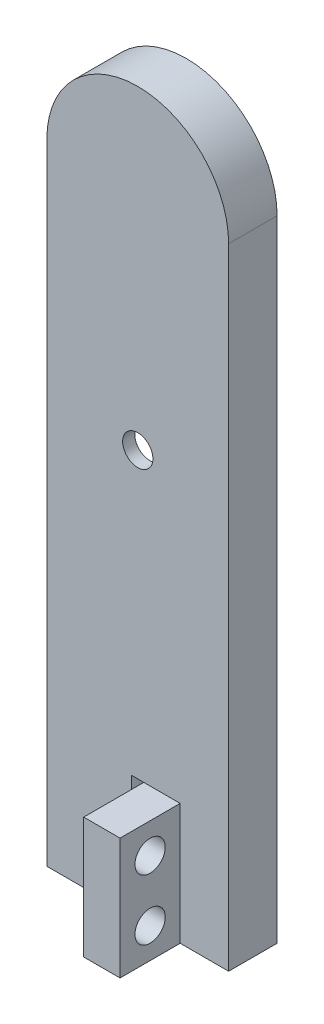
ISO-10303-21;
HEADER;
FILE_DESCRIPTION(('STEP AP214'),'2;1');
FILE_NAME('part.step','',(''),(''),'','','');
FILE_SCHEMA(('AUTOMOTIVE_DESIGN { 1 0 10303 214 1 1 1 1 }'));
ENDSEC;
DATA;
#1=APPLICATION_CONTEXT('core data for automotive mechanical design processes');
#2=APPLICATION_PROTOCOL_DEFINITION('international standard','automotive_design',2000,#1);
#3=PRODUCT_CONTEXT('',#1,'mechanical');
#4=PRODUCT('Part','Part','',(#3));
#5=PRODUCT_RELATED_PRODUCT_CATEGORY('part','',(#4));
#6=PRODUCT_DEFINITION_FORMATION('','',#4);
#7=PRODUCT_DEFINITION_CONTEXT('part definition',#1,'design');
#8=PRODUCT_DEFINITION('design','',#6,#7);
#9=PRODUCT_DEFINITION_SHAPE('','',#8);
#10=(LENGTH_UNIT() NAMED_UNIT(*) SI_UNIT(.MILLI.,.METRE.));
#11=(NAMED_UNIT(*) PLANE_ANGLE_UNIT() SI_UNIT($,.RADIAN.));
#12=(NAMED_UNIT(*) SI_UNIT($,.STERADIAN.) SOLID_ANGLE_UNIT());
#13=UNCERTAINTY_MEASURE_WITH_UNIT(LENGTH_MEASURE(1.E-05),#10,'distance_accuracy_value','');
#14=(GEOMETRIC_REPRESENTATION_CONTEXT(3) GLOBAL_UNCERTAINTY_ASSIGNED_CONTEXT((#13)) GLOBAL_UNIT_ASSIGNED_CONTEXT((#10,
#11,#12)) REPRESENTATION_CONTEXT('',''));
#15=CARTESIAN_POINT('',(0.,0.,0.));
#16=DIRECTION('',(0.,0.,1.));
#17=DIRECTION('',(1.,0.,0.));
#18=AXIS2_PLACEMENT_3D('',#15,#16,#17);
#19=CARTESIAN_POINT('',(0.,52.,4.));
#20=DIRECTION('',(0.,0.,1.));
#21=DIRECTION('',(1.,0.,0.));
#22=AXIS2_PLACEMENT_3D('',#19,#20,#21);
#23=PLANE('',#22);
#24=CARTESIAN_POINT('',(0.,33.5,4.));
#25=DIRECTION('',(0.,0.,1.));
#26=DIRECTION('',(1.,0.,0.));
#27=AXIS2_PLACEMENT_3D('',#24,#25,#26);
#28=CIRCLE('',#27,1.25);
#29=CARTESIAN_POINT('',(1.25,33.5,4.));
#30=VERTEX_POINT('',#29);
#31=EDGE_CURVE('E202',#30,#30,#28,.F.);
#32=ORIENTED_EDGE('',*,*,#31,.T.);
#33=EDGE_LOOP('',(#32));
#34=FACE_BOUND('',#33,.T.);
#35=DIRECTION('',(1.,0.,0.));
#36=VECTOR('',#35,1.);
#37=CARTESIAN_POINT('',(0.,10.,4.));
#38=LINE('',#37,#36);
#39=CARTESIAN_POINT('',(-0.499999999999999,10.,4.));
#40=VERTEX_POINT('',#39);
#41=CARTESIAN_POINT('',(0.499999999999999,10.,4.));
#42=VERTEX_POINT('',#41);
#43=EDGE_CURVE('E199',#40,#42,#38,.T.);
#44=ORIENTED_EDGE('',*,*,#43,.T.);
#45=DIRECTION('',(1.,0.,0.));
#46=VECTOR('',#45,1.);
#47=CARTESIAN_POINT('',(0.,10.,4.));
#48=LINE('',#47,#46);
#49=CARTESIAN_POINT('',(3.5,10.,4.));
#50=VERTEX_POINT('',#49);
#51=EDGE_CURVE('E53',#42,#50,#48,.T.);
#52=ORIENTED_EDGE('',*,*,#51,.T.);
#53=DIRECTION('',(0.,1.,0.));
#54=VECTOR('',#53,1.);
#55=CARTESIAN_POINT('',(3.5,52.,4.));
#56=LINE('',#55,#54);
#57=CARTESIAN_POINT('',(3.5,0.,4.));
#58=VERTEX_POINT('',#57);
#59=EDGE_CURVE('E11',#58,#50,#56,.T.);
#60=ORIENTED_EDGE('',*,*,#59,.F.);
#61=DIRECTION('',(1.,0.,0.));
#62=VECTOR('',#61,1.);
#63=CARTESIAN_POINT('',(7.5,0.,4.));
#64=LINE('',#63,#62);
#65=CARTESIAN_POINT('',(7.5,0.,4.));
#66=VERTEX_POINT('',#65);
#67=EDGE_CURVE('E157',#58,#66,#64,.T.);
#68=ORIENTED_EDGE('',*,*,#67,.T.);
#69=DIRECTION('',(0.,1.,0.));
#70=VECTOR('',#69,1.);
#71=CARTESIAN_POINT('',(7.5,0.,4.));
#72=LINE('',#71,#70);
#73=CARTESIAN_POINT('',(7.5,52.,4.));
#74=VERTEX_POINT('',#73);
#75=EDGE_CURVE('E253',#66,#74,#72,.T.);
#76=ORIENTED_EDGE('',*,*,#75,.T.);
#77=CARTESIAN_POINT('',(0.,52.,4.));
#78=DIRECTION('',(0.,0.,1.));
#79=DIRECTION('',(1.,0.,0.));
#80=AXIS2_PLACEMENT_3D('',#77,#78,#79);
#81=CIRCLE('',#80,7.5);
#82=CARTESIAN_POINT('',(-7.5,52.,4.));
#83=VERTEX_POINT('',#82);
#84=EDGE_CURVE('E255',#74,#83,#81,.T.);
#85=ORIENTED_EDGE('',*,*,#84,.T.);
#86=DIRECTION('',(0.,-1.,0.));
#87=VECTOR('',#86,1.);
#88=CARTESIAN_POINT('',(-7.5,0.,4.));
#89=LINE('',#88,#87);
#90=CARTESIAN_POINT('',(-7.5,0.,4.));
#91=VERTEX_POINT('',#90);
#92=EDGE_CURVE('E257',#83,#91,#89,.T.);
#93=ORIENTED_EDGE('',*,*,#92,.T.);
#94=CARTESIAN_POINT('',(-0.5,0.,4.));
#95=VERTEX_POINT('',#94);
#96=EDGE_CURVE('E250',#91,#95,#64,.T.);
#97=ORIENTED_EDGE('',*,*,#96,.T.);
#98=DIRECTION('',(0.,1.,0.));
#99=VECTOR('',#98,1.);
#100=CARTESIAN_POINT('',(-0.499999999999997,52.,4.));
#101=LINE('',#100,#99);
#102=EDGE_CURVE('E196',#95,#40,#101,.T.);
#103=ORIENTED_EDGE('',*,*,#102,.T.);
#104=EDGE_LOOP('',(#44,#52,#60,#68,#76,#85,#93,#97,#103));
#105=FACE_BOUND('',#104,.T.);
#106=ADVANCED_FACE('F36',(#34,#105),#23,.T.);
#107=CARTESIAN_POINT('',(7.5,0.,4.));
#108=DIRECTION('',(0.,1.,0.));
#109=DIRECTION('',(0.,0.,1.));
#110=AXIS2_PLACEMENT_3D('',#107,#108,#109);
#111=PLANE('',#110);
#112=DIRECTION('',(0.,0.,-1.));
#113=VECTOR('',#112,1.);
#114=CARTESIAN_POINT('',(0.5,0.,16.3));
#115=LINE('',#114,#113);
#116=CARTESIAN_POINT('',(0.5,0.,8.96178465974861));
#117=VERTEX_POINT('',#116);
#118=CARTESIAN_POINT('',(0.5,0.,0.));
#119=VERTEX_POINT('',#118);
#120=EDGE_CURVE('E194',#117,#119,#115,.T.);
#121=ORIENTED_EDGE('',*,*,#120,.T.);
#122=DIRECTION('',(1.,0.,0.));
#123=VECTOR('',#122,1.);
#124=CARTESIAN_POINT('',(7.5,0.,0.));
#125=LINE('',#124,#123);
#126=CARTESIAN_POINT('',(7.5,0.,0.));
#127=VERTEX_POINT('',#126);
#128=EDGE_CURVE('E249',#119,#127,#125,.T.);
#129=ORIENTED_EDGE('',*,*,#128,.T.);
#130=DIRECTION('',(0.,0.,-1.));
#131=VECTOR('',#130,1.);
#132=CARTESIAN_POINT('',(7.5,0.,4.));
#133=LINE('',#132,#131);
#134=EDGE_CURVE('E45',#66,#127,#133,.T.);
#135=ORIENTED_EDGE('',*,*,#134,.F.);
#136=ORIENTED_EDGE('',*,*,#67,.F.);
#137=DIRECTION('',(0.,0.,-1.));
#138=VECTOR('',#137,1.);
#139=CARTESIAN_POINT('',(3.5,0.,8.96178465974861));
#140=LINE('',#139,#138);
#141=CARTESIAN_POINT('',(3.5,0.,8.96178465974861));
#142=VERTEX_POINT('',#141);
#143=EDGE_CURVE('E151',#142,#58,#140,.T.);
#144=ORIENTED_EDGE('',*,*,#143,.F.);
#145=DIRECTION('',(-1.,0.,0.));
#146=VECTOR('',#145,1.);
#147=CARTESIAN_POINT('',(3.5,0.,8.96178465974861));
#148=LINE('',#147,#146);
#149=EDGE_CURVE('E154',#142,#117,#148,.T.);
#150=ORIENTED_EDGE('',*,*,#149,.T.);
#151=EDGE_LOOP('',(#121,#129,#135,#136,#144,#150));
#152=FACE_BOUND('',#151,.T.);
#153=ADVANCED_FACE('F38',(#152),#111,.F.);
#154=DIRECTION('',(0.,0.,-1.));
#155=VECTOR('',#154,1.);
#156=CARTESIAN_POINT('',(-0.5,0.,16.3));
#157=LINE('',#156,#155);
#158=CARTESIAN_POINT('',(-0.499999999999999,0.,0.));
#159=VERTEX_POINT('',#158);
#160=EDGE_CURVE('E188',#95,#159,#157,.T.);
#161=ORIENTED_EDGE('',*,*,#160,.F.);
#162=ORIENTED_EDGE('',*,*,#96,.F.);
#163=DIRECTION('',(0.,0.,-1.));
#164=VECTOR('',#163,1.);
#165=CARTESIAN_POINT('',(-7.5,0.,4.));
#166=LINE('',#165,#164);
#167=CARTESIAN_POINT('',(-7.5,0.,0.));
#168=VERTEX_POINT('',#167);
#169=EDGE_CURVE('E259',#91,#168,#166,.T.);
#170=ORIENTED_EDGE('',*,*,#169,.T.);
#171=EDGE_CURVE('E260',#168,#159,#125,.T.);
#172=ORIENTED_EDGE('',*,*,#171,.T.);
#173=EDGE_LOOP('',(#161,#162,#170,#172));
#174=FACE_BOUND('',#173,.T.);
#175=ADVANCED_FACE('F323',(#174),#111,.F.);
#176=CARTESIAN_POINT('',(0.,52.,0.));
#177=DIRECTION('',(0.,0.,1.));
#178=DIRECTION('',(1.,0.,0.));
#179=AXIS2_PLACEMENT_3D('',#176,#177,#178);
#180=PLANE('',#179);
#181=DIRECTION('',(-0.161684528353419,0.986842496699009,0.));
#182=VECTOR('',#181,1.);
#183=CARTESIAN_POINT('',(10.214455548325,1.67353902293651,0.));
#184=LINE('',#183,#182);
#185=CARTESIAN_POINT('',(5.,33.5,0.));
#186=VERTEX_POINT('',#185);
#187=CARTESIAN_POINT('',(2.29663575823377,50.,0.));
#188=VERTEX_POINT('',#187);
#189=EDGE_CURVE('E210',#186,#188,#184,.T.);
#190=ORIENTED_EDGE('',*,*,#189,.T.);
#191=CARTESIAN_POINT('',(0.,50.,0.));
#192=DIRECTION('',(0.,0.,1.));
#193=DIRECTION('',(1.,0.,0.));
#194=AXIS2_PLACEMENT_3D('',#191,#192,#193);
#195=CIRCLE('',#194,2.29663575823377);
#196=CARTESIAN_POINT('',(-2.29663575823377,50.,0.));
#197=VERTEX_POINT('',#196);
#198=EDGE_CURVE('E205',#197,#188,#195,.F.);
#199=ORIENTED_EDGE('',*,*,#198,.F.);
#200=DIRECTION('',(-0.161684528353419,-0.986842496699009,0.));
#201=VECTOR('',#200,1.);
#202=CARTESIAN_POINT('',(-10.214455548325,1.67353902293651,0.));
#203=LINE('',#202,#201);
#204=CARTESIAN_POINT('',(-5.,33.5,0.));
#205=VERTEX_POINT('',#204);
#206=EDGE_CURVE('E223',#197,#205,#203,.T.);
#207=ORIENTED_EDGE('',*,*,#206,.T.);
#208=DIRECTION('',(0.161380696641222,-0.986892228539466,0.));
#209=VECTOR('',#208,1.);
#210=CARTESIAN_POINT('',(0.465608050517505,0.0761381530640669,0.));
#211=LINE('',#210,#209);
#212=CARTESIAN_POINT('',(-2.30185179538713,17.,0.));
#213=VERTEX_POINT('',#212);
#214=EDGE_CURVE('E226',#205,#213,#211,.T.);
#215=ORIENTED_EDGE('',*,*,#214,.T.);
#216=CARTESIAN_POINT('',(0.,17.,0.));
#217=DIRECTION('',(0.,0.,1.));
#218=DIRECTION('',(1.,0.,0.));
#219=AXIS2_PLACEMENT_3D('',#216,#217,#218);
#220=CIRCLE('',#219,2.30185179538713);
#221=CARTESIAN_POINT('',(2.27233199291966,16.6325370741411,0.));
#222=VERTEX_POINT('',#221);
#223=EDGE_CURVE('E229',#213,#222,#220,.T.);
#224=ORIENTED_EDGE('',*,*,#223,.T.);
#225=DIRECTION('',(-0.159637960443524,-0.987175628541057,0.));
#226=VECTOR('',#225,1.);
#227=CARTESIAN_POINT('',(-0.40670997405777,0.0657698071887931,0.));
#228=LINE('',#227,#226);
#229=EDGE_CURVE('E232',#186,#222,#228,.T.);
#230=ORIENTED_EDGE('',*,*,#229,.F.);
#231=EDGE_LOOP('',(#190,#199,#207,#215,#224,#230));
#232=FACE_BOUND('',#231,.T.);
#233=DIRECTION('',(0.,1.,0.));
#234=VECTOR('',#233,1.);
#235=CARTESIAN_POINT('',(0.5,0.,0.));
#236=LINE('',#235,#234);
#237=CARTESIAN_POINT('',(0.499999999999999,10.,0.));
#238=VERTEX_POINT('',#237);
#239=EDGE_CURVE('E175',#119,#238,#236,.T.);
#240=ORIENTED_EDGE('',*,*,#239,.T.);
#241=DIRECTION('',(-1.,0.,0.));
#242=VECTOR('',#241,1.);
#243=CARTESIAN_POINT('',(0.499999999999999,10.,0.));
#244=LINE('',#243,#242);
#245=CARTESIAN_POINT('',(-0.499999999999999,10.,0.));
#246=VERTEX_POINT('',#245);
#247=EDGE_CURVE('E182',#238,#246,#244,.T.);
#248=ORIENTED_EDGE('',*,*,#247,.T.);
#249=DIRECTION('',(0.,-1.,0.));
#250=VECTOR('',#249,1.);
#251=CARTESIAN_POINT('',(-0.5,0.,0.));
#252=LINE('',#251,#250);
#253=EDGE_CURVE('E185',#246,#159,#252,.T.);
#254=ORIENTED_EDGE('',*,*,#253,.T.);
#255=ORIENTED_EDGE('',*,*,#171,.F.);
#256=DIRECTION('',(0.,-1.,0.));
#257=VECTOR('',#256,1.);
#258=CARTESIAN_POINT('',(-7.5,0.,0.));
#259=LINE('',#258,#257);
#260=CARTESIAN_POINT('',(-7.5,52.,0.));
#261=VERTEX_POINT('',#260);
#262=EDGE_CURVE('E267',#261,#168,#259,.T.);
#263=ORIENTED_EDGE('',*,*,#262,.F.);
#264=CARTESIAN_POINT('',(0.,52.,0.));
#265=DIRECTION('',(0.,0.,1.));
#266=DIRECTION('',(1.,0.,0.));
#267=AXIS2_PLACEMENT_3D('',#264,#265,#266);
#268=CIRCLE('',#267,7.5);
#269=CARTESIAN_POINT('',(7.5,52.,0.));
#270=VERTEX_POINT('',#269);
#271=EDGE_CURVE('E265',#270,#261,#268,.T.);
#272=ORIENTED_EDGE('',*,*,#271,.F.);
#273=DIRECTION('',(0.,1.,0.));
#274=VECTOR('',#273,1.);
#275=CARTESIAN_POINT('',(7.5,0.,0.));
#276=LINE('',#275,#274);
#277=EDGE_CURVE('E263',#127,#270,#276,.T.);
#278=ORIENTED_EDGE('',*,*,#277,.F.);
#279=ORIENTED_EDGE('',*,*,#128,.F.);
#280=EDGE_LOOP('',(#240,#248,#254,#255,#263,#272,#278,#279));
#281=FACE_BOUND('',#280,.T.);
#282=ADVANCED_FACE('F305',(#232,#281),#180,.F.);
#283=CARTESIAN_POINT('',(7.5,0.,4.));
#284=DIRECTION('',(-1.,0.,0.));
#285=DIRECTION('',(0.,0.,1.));
#286=AXIS2_PLACEMENT_3D('',#283,#284,#285);
#287=PLANE('',#286);
#288=ORIENTED_EDGE('',*,*,#277,.T.);
#289=DIRECTION('',(0.,0.,-1.));
#290=VECTOR('',#289,1.);
#291=CARTESIAN_POINT('',(7.5,52.,4.));
#292=LINE('',#291,#290);
#293=EDGE_CURVE('E274',#74,#270,#292,.T.);
#294=ORIENTED_EDGE('',*,*,#293,.F.);
#295=ORIENTED_EDGE('',*,*,#75,.F.);
#296=ORIENTED_EDGE('',*,*,#134,.T.);
#297=EDGE_LOOP('',(#288,#294,#295,#296));
#298=FACE_BOUND('',#297,.T.);
#299=ADVANCED_FACE('F310',(#298),#287,.F.);
#300=CARTESIAN_POINT('',(0.,52.,4.));
#301=DIRECTION('',(0.,0.,-1.));
#302=DIRECTION('',(-1.,0.,0.));
#303=AXIS2_PLACEMENT_3D('',#300,#301,#302);
#304=CYLINDRICAL_SURFACE('',#303,7.5);
#305=ORIENTED_EDGE('',*,*,#271,.T.);
#306=DIRECTION('',(0.,0.,-1.));
#307=VECTOR('',#306,1.);
#308=CARTESIAN_POINT('',(-7.5,52.,4.));
#309=LINE('',#308,#307);
#310=EDGE_CURVE('E271',#83,#261,#309,.T.);
#311=ORIENTED_EDGE('',*,*,#310,.F.);
#312=ORIENTED_EDGE('',*,*,#84,.F.);
#313=ORIENTED_EDGE('',*,*,#293,.T.);
#314=EDGE_LOOP('',(#305,#311,#312,#313));
#315=FACE_BOUND('',#314,.T.);
#316=ADVANCED_FACE('F316',(#315),#304,.T.);
#317=CARTESIAN_POINT('',(-7.5,0.,4.));
#318=DIRECTION('',(1.,0.,0.));
#319=DIRECTION('',(0.,0.,-1.));
#320=AXIS2_PLACEMENT_3D('',#317,#318,#319);
#321=PLANE('',#320);
#322=ORIENTED_EDGE('',*,*,#262,.T.);
#323=ORIENTED_EDGE('',*,*,#169,.F.);
#324=ORIENTED_EDGE('',*,*,#92,.F.);
#325=ORIENTED_EDGE('',*,*,#310,.T.);
#326=EDGE_LOOP('',(#322,#323,#324,#325));
#327=FACE_BOUND('',#326,.T.);
#328=ADVANCED_FACE('F318',(#327),#321,.F.);
#329=CARTESIAN_POINT('',(0.,50.,3.));
#330=DIRECTION('',(0.,0.,-1.));
#331=DIRECTION('',(-1.,0.,0.));
#332=AXIS2_PLACEMENT_3D('',#329,#330,#331);
#333=CYLINDRICAL_SURFACE('',#332,2.29663575823377);
#334=ORIENTED_EDGE('',*,*,#198,.T.);
#335=DIRECTION('',(0.,0.,-1.));
#336=VECTOR('',#335,1.);
#337=CARTESIAN_POINT('',(2.29663575823377,50.,3.));
#338=LINE('',#337,#336);
#339=CARTESIAN_POINT('',(2.29663575823377,50.,3.));
#340=VERTEX_POINT('',#339);
#341=EDGE_CURVE('E221',#340,#188,#338,.T.);
#342=ORIENTED_EDGE('',*,*,#341,.F.);
#343=CARTESIAN_POINT('',(0.,50.,3.));
#344=DIRECTION('',(0.,0.,1.));
#345=DIRECTION('',(1.,0.,0.));
#346=AXIS2_PLACEMENT_3D('',#343,#344,#345);
#347=CIRCLE('',#346,2.29663575823377);
#348=CARTESIAN_POINT('',(-2.29663575823377,50.,3.));
#349=VERTEX_POINT('',#348);
#350=EDGE_CURVE('E206',#349,#340,#347,.F.);
#351=ORIENTED_EDGE('',*,*,#350,.F.);
#352=DIRECTION('',(0.,0.,-1.));
#353=VECTOR('',#352,1.);
#354=CARTESIAN_POINT('',(-2.29663575823377,50.,3.));
#355=LINE('',#354,#353);
#356=EDGE_CURVE('E247',#349,#197,#355,.T.);
#357=ORIENTED_EDGE('',*,*,#356,.T.);
#358=EDGE_LOOP('',(#334,#342,#351,#357));
#359=FACE_BOUND('',#358,.T.);
#360=ADVANCED_FACE('F348',(#359),#333,.F.);
#361=CARTESIAN_POINT('',(-10.214455548325,1.67353902293651,3.));
#362=DIRECTION('',(0.986842496699008,-0.161684528353419,0.));
#363=DIRECTION('',(0.161684528353419,0.986842496699008,0.));
#364=AXIS2_PLACEMENT_3D('',#361,#362,#363);
#365=PLANE('',#364);
#366=ORIENTED_EDGE('',*,*,#206,.F.);
#367=ORIENTED_EDGE('',*,*,#356,.F.);
#368=DIRECTION('',(-0.161684528353419,-0.986842496699009,0.));
#369=VECTOR('',#368,1.);
#370=CARTESIAN_POINT('',(-10.214455548325,1.67353902293651,3.));
#371=LINE('',#370,#369);
#372=CARTESIAN_POINT('',(-5.,33.5,3.));
#373=VERTEX_POINT('',#372);
#374=EDGE_CURVE('E209',#349,#373,#371,.T.);
#375=ORIENTED_EDGE('',*,*,#374,.T.);
#376=DIRECTION('',(0.,0.,-1.));
#377=VECTOR('',#376,1.);
#378=CARTESIAN_POINT('',(-5.,33.5,3.));
#379=LINE('',#378,#377);
#380=EDGE_CURVE('E245',#373,#205,#379,.T.);
#381=ORIENTED_EDGE('',*,*,#380,.T.);
#382=EDGE_LOOP('',(#366,#367,#375,#381));
#383=FACE_BOUND('',#382,.T.);
#384=ADVANCED_FACE('F376',(#383),#365,.T.);
#385=CARTESIAN_POINT('',(0.465608050517505,0.0761381530640669,3.));
#386=DIRECTION('',(0.986892228539466,0.161380696641222,0.));
#387=DIRECTION('',(-0.161380696641222,0.986892228539466,0.));
#388=AXIS2_PLACEMENT_3D('',#385,#386,#387);
#389=PLANE('',#388);
#390=ORIENTED_EDGE('',*,*,#214,.F.);
#391=ORIENTED_EDGE('',*,*,#380,.F.);
#392=DIRECTION('',(0.161380696641222,-0.986892228539466,0.));
#393=VECTOR('',#392,1.);
#394=CARTESIAN_POINT('',(0.465608050517505,0.0761381530640669,3.));
#395=LINE('',#394,#393);
#396=CARTESIAN_POINT('',(-2.30185179538713,17.,3.));
#397=VERTEX_POINT('',#396);
#398=EDGE_CURVE('E212',#373,#397,#395,.T.);
#399=ORIENTED_EDGE('',*,*,#398,.T.);
#400=DIRECTION('',(0.,0.,-1.));
#401=VECTOR('',#400,1.);
#402=CARTESIAN_POINT('',(-2.30185179538713,17.,3.));
#403=LINE('',#402,#401);
#404=EDGE_CURVE('E243',#397,#213,#403,.T.);
#405=ORIENTED_EDGE('',*,*,#404,.T.);
#406=EDGE_LOOP('',(#390,#391,#399,#405));
#407=FACE_BOUND('',#406,.T.);
#408=ADVANCED_FACE('F383',(#407),#389,.T.);
#409=CARTESIAN_POINT('',(0.,17.,3.));
#410=DIRECTION('',(0.,0.,-1.));
#411=DIRECTION('',(-1.,0.,0.));
#412=AXIS2_PLACEMENT_3D('',#409,#410,#411);
#413=CYLINDRICAL_SURFACE('',#412,2.30185179538713);
#414=ORIENTED_EDGE('',*,*,#223,.F.);
#415=ORIENTED_EDGE('',*,*,#404,.F.);
#416=CARTESIAN_POINT('',(0.,17.,3.));
#417=DIRECTION('',(0.,0.,1.));
#418=DIRECTION('',(1.,0.,0.));
#419=AXIS2_PLACEMENT_3D('',#416,#417,#418);
#420=CIRCLE('',#419,2.30185179538713);
#421=CARTESIAN_POINT('',(2.27233199291966,16.6325370741411,3.));
#422=VERTEX_POINT('',#421);
#423=EDGE_CURVE('E214',#397,#422,#420,.T.);
#424=ORIENTED_EDGE('',*,*,#423,.T.);
#425=DIRECTION('',(0.,0.,-1.));
#426=VECTOR('',#425,1.);
#427=CARTESIAN_POINT('',(2.27233199291966,16.6325370741411,3.));
#428=LINE('',#427,#426);
#429=EDGE_CURVE('E241',#422,#222,#428,.T.);
#430=ORIENTED_EDGE('',*,*,#429,.T.);
#431=EDGE_LOOP('',(#414,#415,#424,#430));
#432=FACE_BOUND('',#431,.T.);
#433=ADVANCED_FACE('F390',(#432),#413,.F.);
#434=CARTESIAN_POINT('',(-0.40670997405777,0.0657698071887931,3.));
#435=DIRECTION('',(0.987175628541057,-0.159637960443524,0.));
#436=DIRECTION('',(0.159637960443524,0.987175628541057,0.));
#437=AXIS2_PLACEMENT_3D('',#434,#435,#436);
#438=PLANE('',#437);
#439=ORIENTED_EDGE('',*,*,#229,.T.);
#440=ORIENTED_EDGE('',*,*,#429,.F.);
#441=DIRECTION('',(-0.159637960443524,-0.987175628541057,0.));
#442=VECTOR('',#441,1.);
#443=CARTESIAN_POINT('',(-0.40670997405777,0.0657698071887931,3.));
#444=LINE('',#443,#442);
#445=CARTESIAN_POINT('',(5.,33.5,3.));
#446=VERTEX_POINT('',#445);
#447=EDGE_CURVE('E216',#446,#422,#444,.T.);
#448=ORIENTED_EDGE('',*,*,#447,.F.);
#449=DIRECTION('',(0.,0.,-1.));
#450=VECTOR('',#449,1.);
#451=CARTESIAN_POINT('',(5.,33.5,3.));
#452=LINE('',#451,#450);
#453=EDGE_CURVE('E239',#446,#186,#452,.T.);
#454=ORIENTED_EDGE('',*,*,#453,.T.);
#455=EDGE_LOOP('',(#439,#440,#448,#454));
#456=FACE_BOUND('',#455,.T.);
#457=ADVANCED_FACE('F398',(#456),#438,.F.);
#458=CARTESIAN_POINT('',(10.214455548325,1.67353902293651,3.));
#459=DIRECTION('',(-0.986842496699008,-0.161684528353419,0.));
#460=DIRECTION('',(0.161684528353419,-0.986842496699008,0.));
#461=AXIS2_PLACEMENT_3D('',#458,#459,#460);
#462=PLANE('',#461);
#463=ORIENTED_EDGE('',*,*,#189,.F.);
#464=ORIENTED_EDGE('',*,*,#453,.F.);
#465=DIRECTION('',(-0.161684528353419,0.986842496699009,0.));
#466=VECTOR('',#465,1.);
#467=CARTESIAN_POINT('',(10.214455548325,1.67353902293651,3.));
#468=LINE('',#467,#466);
#469=EDGE_CURVE('E219',#446,#340,#468,.T.);
#470=ORIENTED_EDGE('',*,*,#469,.T.);
#471=ORIENTED_EDGE('',*,*,#341,.T.);
#472=EDGE_LOOP('',(#463,#464,#470,#471));
#473=FACE_BOUND('',#472,.T.);
#474=ADVANCED_FACE('F406',(#473),#462,.T.);
#475=CARTESIAN_POINT('',(0.,0.,3.));
#476=DIRECTION('',(0.,0.,1.));
#477=DIRECTION('',(1.,0.,0.));
#478=AXIS2_PLACEMENT_3D('',#475,#476,#477);
#479=PLANE('',#478);
#480=CARTESIAN_POINT('',(0.,33.5,3.));
#481=DIRECTION('',(0.,0.,1.));
#482=DIRECTION('',(1.,0.,0.));
#483=AXIS2_PLACEMENT_3D('',#480,#481,#482);
#484=CIRCLE('',#483,1.25);
#485=CARTESIAN_POINT('',(1.25,33.5,3.));
#486=VERTEX_POINT('',#485);
#487=EDGE_CURVE('E201',#486,#486,#484,.F.);
#488=ORIENTED_EDGE('',*,*,#487,.F.);
#489=EDGE_LOOP('',(#488));
#490=FACE_BOUND('',#489,.T.);
#491=ORIENTED_EDGE('',*,*,#350,.T.);
#492=ORIENTED_EDGE('',*,*,#469,.F.);
#493=ORIENTED_EDGE('',*,*,#447,.T.);
#494=ORIENTED_EDGE('',*,*,#423,.F.);
#495=ORIENTED_EDGE('',*,*,#398,.F.);
#496=ORIENTED_EDGE('',*,*,#374,.F.);
#497=EDGE_LOOP('',(#491,#492,#493,#494,#495,#496));
#498=FACE_BOUND('',#497,.T.);
#499=ADVANCED_FACE('F414',(#490,#498),#479,.F.);
#500=CARTESIAN_POINT('',(0.,33.5,12.4));
#501=DIRECTION('',(0.,0.,-1.));
#502=DIRECTION('',(-1.,0.,0.));
#503=AXIS2_PLACEMENT_3D('',#500,#501,#502);
#504=CYLINDRICAL_SURFACE('',#503,1.25);
#505=ORIENTED_EDGE('',*,*,#31,.F.);
#506=EDGE_LOOP('',(#505));
#507=FACE_BOUND('',#506,.T.);
#508=ORIENTED_EDGE('',*,*,#487,.T.);
#509=EDGE_LOOP('',(#508));
#510=FACE_BOUND('',#509,.T.);
#511=ADVANCED_FACE('F338',(#507,#510),#504,.F.);
#512=CARTESIAN_POINT('',(0.5,0.,16.3));
#513=DIRECTION('',(-1.,0.,0.));
#514=DIRECTION('',(0.,-1.,0.));
#515=AXIS2_PLACEMENT_3D('',#512,#513,#514);
#516=PLANE('',#515);
#517=CARTESIAN_POINT('',(0.5,7.5,6.48089232987431));
#518=DIRECTION('',(1.,0.,0.));
#519=DIRECTION('',(0.,0.,-1.));
#520=AXIS2_PLACEMENT_3D('',#517,#518,#519);
#521=CIRCLE('',#520,1.25);
#522=CARTESIAN_POINT('',(0.5,7.5,5.23089232987431));
#523=VERTEX_POINT('',#522);
#524=EDGE_CURVE('E282',#523,#523,#521,.T.);
#525=ORIENTED_EDGE('',*,*,#524,.T.);
#526=EDGE_LOOP('',(#525));
#527=FACE_BOUND('',#526,.T.);
#528=CARTESIAN_POINT('',(0.5,2.5,6.48089232987431));
#529=DIRECTION('',(1.,0.,0.));
#530=DIRECTION('',(0.,0.,1.));
#531=AXIS2_PLACEMENT_3D('',#528,#529,#530);
#532=CIRCLE('',#531,1.25);
#533=CARTESIAN_POINT('',(0.5,2.5,7.73089232987431));
#534=VERTEX_POINT('',#533);
#535=EDGE_CURVE('E287',#534,#534,#532,.T.);
#536=ORIENTED_EDGE('',*,*,#535,.T.);
#537=EDGE_LOOP('',(#536));
#538=FACE_BOUND('',#537,.T.);
#539=DIRECTION('',(0.,0.,-1.));
#540=VECTOR('',#539,1.);
#541=CARTESIAN_POINT('',(0.499999999999999,10.,16.3));
#542=LINE('',#541,#540);
#543=EDGE_CURVE('E192',#42,#238,#542,.T.);
#544=ORIENTED_EDGE('',*,*,#543,.T.);
#545=ORIENTED_EDGE('',*,*,#239,.F.);
#546=ORIENTED_EDGE('',*,*,#120,.F.);
#547=DIRECTION('',(0.,-1.,0.));
#548=VECTOR('',#547,1.);
#549=CARTESIAN_POINT('',(0.5,10.,8.96178465974861));
#550=LINE('',#549,#548);
#551=CARTESIAN_POINT('',(0.5,10.,8.96178465974861));
#552=VERTEX_POINT('',#551);
#553=EDGE_CURVE('E172',#552,#117,#550,.T.);
#554=ORIENTED_EDGE('',*,*,#553,.F.);
#555=DIRECTION('',(0.,0.,1.));
#556=VECTOR('',#555,1.);
#557=CARTESIAN_POINT('',(0.5,10.,8.96178465974861));
#558=LINE('',#557,#556);
#559=EDGE_CURVE('E168',#42,#552,#558,.T.);
#560=ORIENTED_EDGE('',*,*,#559,.F.);
#561=EDGE_LOOP('',(#544,#545,#546,#554,#560));
#562=FACE_BOUND('',#561,.T.);
#563=ADVANCED_FACE('F299',(#527,#538,#562),#516,.T.);
#564=CARTESIAN_POINT('',(0.499999999999999,10.,16.3));
#565=DIRECTION('',(0.,-1.,0.));
#566=DIRECTION('',(0.,0.,-1.));
#567=AXIS2_PLACEMENT_3D('',#564,#565,#566);
#568=PLANE('',#567);
#569=DIRECTION('',(0.,0.,-1.));
#570=VECTOR('',#569,1.);
#571=CARTESIAN_POINT('',(-0.499999999999999,10.,16.3));
#572=LINE('',#571,#570);
#573=EDGE_CURVE('E190',#40,#246,#572,.T.);
#574=ORIENTED_EDGE('',*,*,#573,.T.);
#575=ORIENTED_EDGE('',*,*,#247,.F.);
#576=ORIENTED_EDGE('',*,*,#543,.F.);
#577=ORIENTED_EDGE('',*,*,#43,.F.);
#578=EDGE_LOOP('',(#574,#575,#576,#577));
#579=FACE_BOUND('',#578,.T.);
#580=ADVANCED_FACE('F330',(#579),#568,.T.);
#581=CARTESIAN_POINT('',(-0.5,0.,16.3));
#582=DIRECTION('',(1.,0.,0.));
#583=DIRECTION('',(0.,1.,0.));
#584=AXIS2_PLACEMENT_3D('',#581,#582,#583);
#585=PLANE('',#584);
#586=ORIENTED_EDGE('',*,*,#160,.T.);
#587=ORIENTED_EDGE('',*,*,#253,.F.);
#588=ORIENTED_EDGE('',*,*,#573,.F.);
#589=ORIENTED_EDGE('',*,*,#102,.F.);
#590=EDGE_LOOP('',(#586,#587,#588,#589));
#591=FACE_BOUND('',#590,.T.);
#592=ADVANCED_FACE('F326',(#591),#585,.T.);
#593=CARTESIAN_POINT('',(3.5,10.,8.96178465974861));
#594=DIRECTION('',(0.,0.,-1.));
#595=DIRECTION('',(-1.,0.,0.));
#596=AXIS2_PLACEMENT_3D('',#593,#594,#595);
#597=PLANE('',#596);
#598=ORIENTED_EDGE('',*,*,#553,.T.);
#599=ORIENTED_EDGE('',*,*,#149,.F.);
#600=DIRECTION('',(0.,-1.,0.));
#601=VECTOR('',#600,1.);
#602=CARTESIAN_POINT('',(3.5,10.,8.96178465974861));
#603=LINE('',#602,#601);
#604=CARTESIAN_POINT('',(3.5,10.,8.96178465974861));
#605=VERTEX_POINT('',#604);
#606=EDGE_CURVE('E160',#605,#142,#603,.T.);
#607=ORIENTED_EDGE('',*,*,#606,.F.);
#608=DIRECTION('',(-1.,0.,0.));
#609=VECTOR('',#608,1.);
#610=CARTESIAN_POINT('',(3.5,10.,8.96178465974861));
#611=LINE('',#610,#609);
#612=EDGE_CURVE('E173',#605,#552,#611,.T.);
#613=ORIENTED_EDGE('',*,*,#612,.T.);
#614=EDGE_LOOP('',(#598,#599,#607,#613));
#615=FACE_BOUND('',#614,.T.);
#616=ADVANCED_FACE('F170',(#615),#597,.F.);
#617=CARTESIAN_POINT('',(3.5,10.,8.96178465974861));
#618=DIRECTION('',(0.,-1.,0.));
#619=DIRECTION('',(0.,0.,-1.));
#620=AXIS2_PLACEMENT_3D('',#617,#618,#619);
#621=PLANE('',#620);
#622=ORIENTED_EDGE('',*,*,#51,.F.);
#623=ORIENTED_EDGE('',*,*,#559,.T.);
#624=ORIENTED_EDGE('',*,*,#612,.F.);
#625=DIRECTION('',(0.,0.,1.));
#626=VECTOR('',#625,1.);
#627=CARTESIAN_POINT('',(3.5,10.,8.96178465974861));
#628=LINE('',#627,#626);
#629=EDGE_CURVE('E159',#50,#605,#628,.T.);
#630=ORIENTED_EDGE('',*,*,#629,.F.);
#631=EDGE_LOOP('',(#622,#623,#624,#630));
#632=FACE_BOUND('',#631,.T.);
#633=ADVANCED_FACE('F297',(#632),#621,.F.);
#634=CARTESIAN_POINT('',(3.5,0.,0.));
#635=DIRECTION('',(1.,0.,0.));
#636=DIRECTION('',(0.,0.,-1.));
#637=AXIS2_PLACEMENT_3D('',#634,#635,#636);
#638=PLANE('',#637);
#639=CARTESIAN_POINT('',(3.5,7.5,6.48089232987431));
#640=DIRECTION('',(1.,0.,0.));
#641=DIRECTION('',(0.,0.,-1.));
#642=AXIS2_PLACEMENT_3D('',#639,#640,#641);
#643=CIRCLE('',#642,1.25);
#644=CARTESIAN_POINT('',(3.5,7.5,5.23089232987431));
#645=VERTEX_POINT('',#644);
#646=EDGE_CURVE('E40',#645,#645,#643,.F.);
#647=ORIENTED_EDGE('',*,*,#646,.T.);
#648=EDGE_LOOP('',(#647));
#649=FACE_BOUND('',#648,.T.);
#650=CARTESIAN_POINT('',(3.5,2.5,6.48089232987431));
#651=DIRECTION('',(1.,0.,0.));
#652=DIRECTION('',(0.,0.,-1.));
#653=AXIS2_PLACEMENT_3D('',#650,#651,#652);
#654=CIRCLE('',#653,1.25);
#655=CARTESIAN_POINT('',(3.5,2.5,5.23089232987431));
#656=VERTEX_POINT('',#655);
#657=EDGE_CURVE('E280',#656,#656,#654,.F.);
#658=ORIENTED_EDGE('',*,*,#657,.T.);
#659=EDGE_LOOP('',(#658));
#660=FACE_BOUND('',#659,.T.);
#661=ORIENTED_EDGE('',*,*,#143,.T.);
#662=ORIENTED_EDGE('',*,*,#59,.T.);
#663=ORIENTED_EDGE('',*,*,#629,.T.);
#664=ORIENTED_EDGE('',*,*,#606,.T.);
#665=EDGE_LOOP('',(#661,#662,#663,#664));
#666=FACE_BOUND('',#665,.T.);
#667=ADVANCED_FACE('F163',(#649,#660,#666),#638,.T.);
#668=CARTESIAN_POINT('',(5.6,2.5,6.48089232987431));
#669=DIRECTION('',(-1.,0.,0.));
#670=DIRECTION('',(0.,0.,1.));
#671=AXIS2_PLACEMENT_3D('',#668,#669,#670);
#672=CYLINDRICAL_SURFACE('',#671,1.25);
#673=ORIENTED_EDGE('',*,*,#657,.F.);
#674=EDGE_LOOP('',(#673));
#675=FACE_BOUND('',#674,.T.);
#676=ORIENTED_EDGE('',*,*,#535,.F.);
#677=EDGE_LOOP('',(#676));
#678=FACE_BOUND('',#677,.T.);
#679=ADVANCED_FACE('F452',(#675,#678),#672,.F.);
#680=CARTESIAN_POINT('',(5.6,7.5,6.48089232987431));
#681=DIRECTION('',(-1.,0.,0.));
#682=DIRECTION('',(0.,0.,1.));
#683=AXIS2_PLACEMENT_3D('',#680,#681,#682);
#684=CYLINDRICAL_SURFACE('',#683,1.25);
#685=ORIENTED_EDGE('',*,*,#646,.F.);
#686=EDGE_LOOP('',(#685));
#687=FACE_BOUND('',#686,.T.);
#688=ORIENTED_EDGE('',*,*,#524,.F.);
#689=EDGE_LOOP('',(#688));
#690=FACE_BOUND('',#689,.T.);
#691=ADVANCED_FACE('F462',(#687,#690),#684,.F.);
#692=CLOSED_SHELL('',(#106,#153,#175,#282,#299,#316,#328,#360,#384,#408,#433,#457,#474,#499,
#511,#563,#580,#592,#616,#633,#667,#679,#691));
#693=MANIFOLD_SOLID_BREP('B2',#692);
#694=ADVANCED_BREP_SHAPE_REPRESENTATION('',(#18,#693),#14);
#695=SHAPE_DEFINITION_REPRESENTATION(#9,#694);
ENDSEC;
END-ISO-10303-21;
